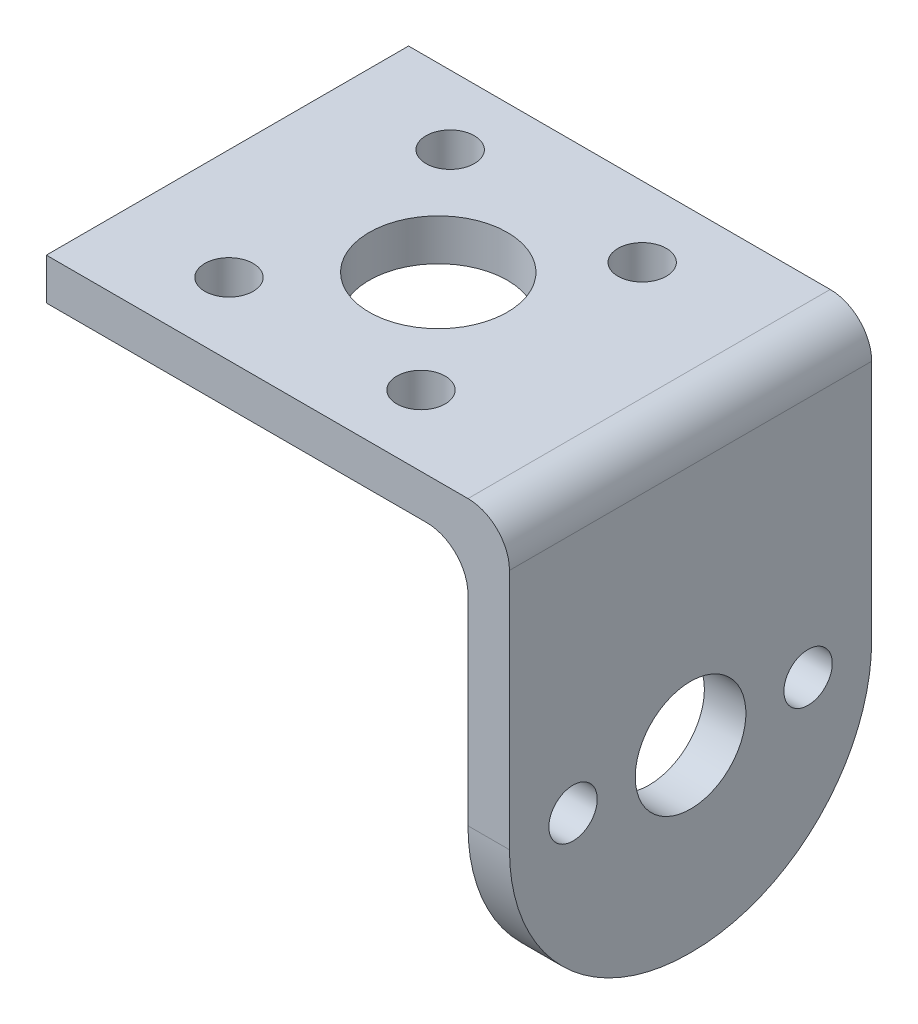
ISO-10303-21;
HEADER;
FILE_DESCRIPTION(('STEP AP214'),'2;1');
FILE_NAME('part.step','',(''),(''),'','','');
FILE_SCHEMA(('AUTOMOTIVE_DESIGN { 1 0 10303 214 1 1 1 1 }'));
ENDSEC;
DATA;
#1=APPLICATION_CONTEXT('core data for automotive mechanical design processes');
#2=APPLICATION_PROTOCOL_DEFINITION('international standard','automotive_design',2000,#1);
#3=PRODUCT_CONTEXT('',#1,'mechanical');
#4=PRODUCT('Part','Part','',(#3));
#5=PRODUCT_RELATED_PRODUCT_CATEGORY('part','',(#4));
#6=PRODUCT_DEFINITION_FORMATION('','',#4);
#7=PRODUCT_DEFINITION_CONTEXT('part definition',#1,'design');
#8=PRODUCT_DEFINITION('design','',#6,#7);
#9=PRODUCT_DEFINITION_SHAPE('','',#8);
#10=(LENGTH_UNIT() NAMED_UNIT(*) SI_UNIT(.MILLI.,.METRE.));
#11=(NAMED_UNIT(*) PLANE_ANGLE_UNIT() SI_UNIT($,.RADIAN.));
#12=(NAMED_UNIT(*) SI_UNIT($,.STERADIAN.) SOLID_ANGLE_UNIT());
#13=UNCERTAINTY_MEASURE_WITH_UNIT(LENGTH_MEASURE(1.E-05),#10,'distance_accuracy_value','');
#14=(GEOMETRIC_REPRESENTATION_CONTEXT(3) GLOBAL_UNCERTAINTY_ASSIGNED_CONTEXT((#13)) GLOBAL_UNIT_ASSIGNED_CONTEXT((#10,
#11,#12)) REPRESENTATION_CONTEXT('',''));
#15=CARTESIAN_POINT('',(0.,0.,0.));
#16=DIRECTION('',(0.,0.,1.));
#17=DIRECTION('',(1.,0.,0.));
#18=AXIS2_PLACEMENT_3D('',#15,#16,#17);
#19=CARTESIAN_POINT('',(0.,3.,0.));
#20=DIRECTION('',(1.,0.,0.));
#21=DIRECTION('',(0.,0.,-1.));
#22=AXIS2_PLACEMENT_3D('',#19,#20,#21);
#23=PLANE('',#22);
#24=DIRECTION('',(0.,0.,1.));
#25=VECTOR('',#24,1.);
#26=CARTESIAN_POINT('',(0.,0.,0.));
#27=LINE('',#26,#25);
#28=CARTESIAN_POINT('',(0.,0.,-26.2));
#29=VERTEX_POINT('',#28);
#30=CARTESIAN_POINT('',(0.,0.,0.));
#31=VERTEX_POINT('',#30);
#32=EDGE_CURVE('E149',#29,#31,#27,.T.);
#33=ORIENTED_EDGE('',*,*,#32,.T.);
#34=DIRECTION('',(0.,-1.,0.));
#35=VECTOR('',#34,1.);
#36=CARTESIAN_POINT('',(0.,3.,0.));
#37=LINE('',#36,#35);
#38=CARTESIAN_POINT('',(0.,3.,0.));
#39=VERTEX_POINT('',#38);
#40=EDGE_CURVE('E129',#39,#31,#37,.T.);
#41=ORIENTED_EDGE('',*,*,#40,.F.);
#42=DIRECTION('',(0.,0.,1.));
#43=VECTOR('',#42,1.);
#44=CARTESIAN_POINT('',(0.,3.,0.));
#45=LINE('',#44,#43);
#46=CARTESIAN_POINT('',(0.,3.,-26.2));
#47=VERTEX_POINT('',#46);
#48=EDGE_CURVE('E138',#47,#39,#45,.T.);
#49=ORIENTED_EDGE('',*,*,#48,.F.);
#50=DIRECTION('',(0.,-1.,0.));
#51=VECTOR('',#50,1.);
#52=CARTESIAN_POINT('',(0.,3.,-26.2));
#53=LINE('',#52,#51);
#54=EDGE_CURVE('E285',#47,#29,#53,.T.);
#55=ORIENTED_EDGE('',*,*,#54,.T.);
#56=EDGE_LOOP('',(#33,#41,#49,#55));
#57=FACE_BOUND('',#56,.T.);
#58=ADVANCED_FACE('F45',(#57),#23,.F.);
#59=CARTESIAN_POINT('',(0.,3.,0.));
#60=DIRECTION('',(0.,0.,-1.));
#61=DIRECTION('',(-1.,0.,0.));
#62=AXIS2_PLACEMENT_3D('',#59,#60,#61);
#63=PLANE('',#62);
#64=DIRECTION('',(0.,-1.,0.));
#65=VECTOR('',#64,1.);
#66=CARTESIAN_POINT('',(33.5,3.,0.));
#67=LINE('',#66,#65);
#68=CARTESIAN_POINT('',(33.5,0.,0.));
#69=VERTEX_POINT('',#68);
#70=CARTESIAN_POINT('',(33.5,-17.5,0.));
#71=VERTEX_POINT('',#70);
#72=EDGE_CURVE('E152',#69,#71,#67,.T.);
#73=ORIENTED_EDGE('',*,*,#72,.F.);
#74=CARTESIAN_POINT('',(30.5,0.,0.));
#75=DIRECTION('',(0.,0.,-1.));
#76=DIRECTION('',(-1.,0.,0.));
#77=AXIS2_PLACEMENT_3D('',#74,#75,#76);
#78=CIRCLE('',#77,3.);
#79=CARTESIAN_POINT('',(30.5,3.,0.));
#80=VERTEX_POINT('',#79);
#81=EDGE_CURVE('E132',#69,#80,#78,.F.);
#82=ORIENTED_EDGE('',*,*,#81,.T.);
#83=DIRECTION('',(1.,0.,0.));
#84=VECTOR('',#83,1.);
#85=CARTESIAN_POINT('',(0.,3.,0.));
#86=LINE('',#85,#84);
#87=EDGE_CURVE('E124',#39,#80,#86,.T.);
#88=ORIENTED_EDGE('',*,*,#87,.F.);
#89=ORIENTED_EDGE('',*,*,#40,.T.);
#90=DIRECTION('',(1.,0.,0.));
#91=VECTOR('',#90,1.);
#92=CARTESIAN_POINT('',(0.,0.,0.));
#93=LINE('',#92,#91);
#94=CARTESIAN_POINT('',(27.5,0.,0.));
#95=VERTEX_POINT('',#94);
#96=EDGE_CURVE('E288',#31,#95,#93,.T.);
#97=ORIENTED_EDGE('',*,*,#96,.T.);
#98=CARTESIAN_POINT('',(27.5,-3.,0.));
#99=DIRECTION('',(0.,0.,-1.));
#100=DIRECTION('',(-1.,0.,0.));
#101=AXIS2_PLACEMENT_3D('',#98,#99,#100);
#102=CIRCLE('',#101,3.);
#103=CARTESIAN_POINT('',(30.5,-3.00000000000001,0.));
#104=VERTEX_POINT('',#103);
#105=EDGE_CURVE('E11',#95,#104,#102,.T.);
#106=ORIENTED_EDGE('',*,*,#105,.T.);
#107=DIRECTION('',(0.,1.,0.));
#108=VECTOR('',#107,1.);
#109=CARTESIAN_POINT('',(30.5,-30.5,0.));
#110=LINE('',#109,#108);
#111=CARTESIAN_POINT('',(30.5,-17.5,0.));
#112=VERTEX_POINT('',#111);
#113=EDGE_CURVE('E279',#112,#104,#110,.T.);
#114=ORIENTED_EDGE('',*,*,#113,.F.);
#115=DIRECTION('',(-1.,0.,0.));
#116=VECTOR('',#115,1.);
#117=CARTESIAN_POINT('',(33.5,-17.5,0.));
#118=LINE('',#117,#116);
#119=EDGE_CURVE('E172',#112,#71,#118,.F.);
#120=ORIENTED_EDGE('',*,*,#119,.T.);
#121=EDGE_LOOP('',(#73,#82,#88,#89,#97,#106,#114,#120));
#122=FACE_BOUND('',#121,.T.);
#123=ADVANCED_FACE('F126',(#122),#63,.F.);
#124=CARTESIAN_POINT('',(33.5,3.,0.));
#125=DIRECTION('',(-1.,0.,0.));
#126=DIRECTION('',(0.,0.,1.));
#127=AXIS2_PLACEMENT_3D('',#124,#125,#126);
#128=PLANE('',#127);
#129=CARTESIAN_POINT('',(33.5,-17.5,-21.6));
#130=DIRECTION('',(-1.,0.,0.));
#131=DIRECTION('',(0.,0.,1.));
#132=AXIS2_PLACEMENT_3D('',#129,#130,#131);
#133=CIRCLE('',#132,1.75);
#134=CARTESIAN_POINT('',(33.5,-17.5,-19.85));
#135=VERTEX_POINT('',#134);
#136=EDGE_CURVE('E223',#135,#135,#133,.F.);
#137=ORIENTED_EDGE('',*,*,#136,.F.);
#138=EDGE_LOOP('',(#137));
#139=FACE_BOUND('',#138,.T.);
#140=CARTESIAN_POINT('',(33.5,-17.5,-4.6));
#141=DIRECTION('',(-1.,0.,0.));
#142=DIRECTION('',(0.,0.,1.));
#143=AXIS2_PLACEMENT_3D('',#140,#141,#142);
#144=CIRCLE('',#143,1.75);
#145=CARTESIAN_POINT('',(33.5,-17.5,-2.85));
#146=VERTEX_POINT('',#145);
#147=EDGE_CURVE('E211',#146,#146,#144,.F.);
#148=ORIENTED_EDGE('',*,*,#147,.F.);
#149=EDGE_LOOP('',(#148));
#150=FACE_BOUND('',#149,.T.);
#151=CARTESIAN_POINT('',(33.5,-17.5,-13.1));
#152=DIRECTION('',(-1.,0.,0.));
#153=DIRECTION('',(0.,0.,1.));
#154=AXIS2_PLACEMENT_3D('',#151,#152,#153);
#155=CIRCLE('',#154,4.);
#156=CARTESIAN_POINT('',(33.5,-17.5,-9.1));
#157=VERTEX_POINT('',#156);
#158=EDGE_CURVE('E207',#157,#157,#155,.F.);
#159=ORIENTED_EDGE('',*,*,#158,.F.);
#160=EDGE_LOOP('',(#159));
#161=FACE_BOUND('',#160,.T.);
#162=DIRECTION('',(0.,-1.,0.));
#163=VECTOR('',#162,1.);
#164=CARTESIAN_POINT('',(33.5,3.,-26.2));
#165=LINE('',#164,#163);
#166=CARTESIAN_POINT('',(33.5,0.,-26.2));
#167=VERTEX_POINT('',#166);
#168=CARTESIAN_POINT('',(33.5,-17.5,-26.2));
#169=VERTEX_POINT('',#168);
#170=EDGE_CURVE('E159',#167,#169,#165,.T.);
#171=ORIENTED_EDGE('',*,*,#170,.F.);
#172=DIRECTION('',(0.,0.,-1.));
#173=VECTOR('',#172,1.);
#174=CARTESIAN_POINT('',(33.5,0.,0.));
#175=LINE('',#174,#173);
#176=EDGE_CURVE('E63',#167,#69,#175,.F.);
#177=ORIENTED_EDGE('',*,*,#176,.T.);
#178=ORIENTED_EDGE('',*,*,#72,.T.);
#179=CARTESIAN_POINT('',(33.5,-17.5,-13.));
#180=DIRECTION('',(-1.,0.,0.));
#181=DIRECTION('',(0.,0.,1.));
#182=AXIS2_PLACEMENT_3D('',#179,#180,#181);
#183=CIRCLE('',#182,13.);
#184=CARTESIAN_POINT('',(33.5,-30.5,-13.));
#185=VERTEX_POINT('',#184);
#186=EDGE_CURVE('E180',#71,#185,#183,.F.);
#187=ORIENTED_EDGE('',*,*,#186,.T.);
#188=DIRECTION('',(0.,0.,1.));
#189=VECTOR('',#188,1.);
#190=CARTESIAN_POINT('',(33.5,-30.5,0.));
#191=LINE('',#190,#189);
#192=CARTESIAN_POINT('',(33.5,-30.5,-13.2));
#193=VERTEX_POINT('',#192);
#194=EDGE_CURVE('E264',#193,#185,#191,.T.);
#195=ORIENTED_EDGE('',*,*,#194,.F.);
#196=CARTESIAN_POINT('',(33.5,-17.5,-13.2));
#197=DIRECTION('',(-1.,0.,0.));
#198=DIRECTION('',(0.,0.,1.));
#199=AXIS2_PLACEMENT_3D('',#196,#197,#198);
#200=CIRCLE('',#199,13.);
#201=EDGE_CURVE('E176',#193,#169,#200,.F.);
#202=ORIENTED_EDGE('',*,*,#201,.T.);
#203=EDGE_LOOP('',(#171,#177,#178,#187,#195,#202));
#204=FACE_BOUND('',#203,.T.);
#205=ADVANCED_FACE('F299',(#139,#150,#161,#204),#128,.F.);
#206=CARTESIAN_POINT('',(0.,3.,-26.2));
#207=DIRECTION('',(0.,0.,1.));
#208=DIRECTION('',(1.,0.,0.));
#209=AXIS2_PLACEMENT_3D('',#206,#207,#208);
#210=PLANE('',#209);
#211=DIRECTION('',(-1.,0.,0.));
#212=VECTOR('',#211,1.);
#213=CARTESIAN_POINT('',(0.,3.,-26.2));
#214=LINE('',#213,#212);
#215=CARTESIAN_POINT('',(30.5,3.,-26.2));
#216=VERTEX_POINT('',#215);
#217=EDGE_CURVE('E137',#216,#47,#214,.T.);
#218=ORIENTED_EDGE('',*,*,#217,.F.);
#219=CARTESIAN_POINT('',(30.5,0.,-26.2));
#220=DIRECTION('',(0.,0.,1.));
#221=DIRECTION('',(1.,0.,0.));
#222=AXIS2_PLACEMENT_3D('',#219,#220,#221);
#223=CIRCLE('',#222,3.);
#224=EDGE_CURVE('E71',#216,#167,#223,.F.);
#225=ORIENTED_EDGE('',*,*,#224,.T.);
#226=ORIENTED_EDGE('',*,*,#170,.T.);
#227=DIRECTION('',(1.,0.,0.));
#228=VECTOR('',#227,1.);
#229=CARTESIAN_POINT('',(30.5,-17.5,-26.2));
#230=LINE('',#229,#228);
#231=CARTESIAN_POINT('',(30.5,-17.5,-26.2));
#232=VERTEX_POINT('',#231);
#233=EDGE_CURVE('E183',#169,#232,#230,.F.);
#234=ORIENTED_EDGE('',*,*,#233,.T.);
#235=DIRECTION('',(0.,1.,0.));
#236=VECTOR('',#235,1.);
#237=CARTESIAN_POINT('',(30.5,-30.5,-26.2));
#238=LINE('',#237,#236);
#239=CARTESIAN_POINT('',(30.5,-3.00000000000001,-26.2));
#240=VERTEX_POINT('',#239);
#241=EDGE_CURVE('E275',#232,#240,#238,.T.);
#242=ORIENTED_EDGE('',*,*,#241,.T.);
#243=CARTESIAN_POINT('',(27.5,-3.,-26.2));
#244=DIRECTION('',(0.,0.,1.));
#245=DIRECTION('',(1.,0.,0.));
#246=AXIS2_PLACEMENT_3D('',#243,#244,#245);
#247=CIRCLE('',#246,3.);
#248=CARTESIAN_POINT('',(27.5,0.,-26.2));
#249=VERTEX_POINT('',#248);
#250=EDGE_CURVE('E55',#240,#249,#247,.T.);
#251=ORIENTED_EDGE('',*,*,#250,.T.);
#252=DIRECTION('',(-1.,0.,0.));
#253=VECTOR('',#252,1.);
#254=CARTESIAN_POINT('',(0.,0.,-26.2));
#255=LINE('',#254,#253);
#256=EDGE_CURVE('E146',#249,#29,#255,.T.);
#257=ORIENTED_EDGE('',*,*,#256,.T.);
#258=ORIENTED_EDGE('',*,*,#54,.F.);
#259=EDGE_LOOP('',(#218,#225,#226,#234,#242,#251,#257,#258));
#260=FACE_BOUND('',#259,.T.);
#261=ADVANCED_FACE('F295',(#260),#210,.F.);
#262=CARTESIAN_POINT('',(0.,3.,0.));
#263=DIRECTION('',(0.,-1.,0.));
#264=DIRECTION('',(0.,0.,-1.));
#265=AXIS2_PLACEMENT_3D('',#262,#263,#264);
#266=PLANE('',#265);
#267=CARTESIAN_POINT('',(8.,3.,-5.21134733643946));
#268=DIRECTION('',(0.,-1.,0.));
#269=DIRECTION('',(0.,0.,-1.));
#270=AXIS2_PLACEMENT_3D('',#267,#268,#269);
#271=CIRCLE('',#270,1.75);
#272=CARTESIAN_POINT('',(8.,3.,-6.96134733643946));
#273=VERTEX_POINT('',#272);
#274=EDGE_CURVE('E249',#273,#273,#271,.T.);
#275=ORIENTED_EDGE('',*,*,#274,.T.);
#276=EDGE_LOOP('',(#275));
#277=FACE_BOUND('',#276,.T.);
#278=CARTESIAN_POINT('',(22.,3.,-21.1));
#279=DIRECTION('',(0.,-1.,0.));
#280=DIRECTION('',(0.,0.,-1.));
#281=AXIS2_PLACEMENT_3D('',#278,#279,#280);
#282=CIRCLE('',#281,1.75);
#283=CARTESIAN_POINT('',(22.,3.,-22.85));
#284=VERTEX_POINT('',#283);
#285=EDGE_CURVE('E232',#284,#284,#282,.T.);
#286=ORIENTED_EDGE('',*,*,#285,.T.);
#287=EDGE_LOOP('',(#286));
#288=FACE_BOUND('',#287,.T.);
#289=CARTESIAN_POINT('',(22.,3.,-5.09999999999999));
#290=DIRECTION('',(0.,-1.,0.));
#291=DIRECTION('',(0.,0.,-1.));
#292=AXIS2_PLACEMENT_3D('',#289,#290,#291);
#293=CIRCLE('',#292,1.75);
#294=CARTESIAN_POINT('',(22.,3.,-6.84999999999999));
#295=VERTEX_POINT('',#294);
#296=EDGE_CURVE('E233',#295,#295,#293,.T.);
#297=ORIENTED_EDGE('',*,*,#296,.T.);
#298=EDGE_LOOP('',(#297));
#299=FACE_BOUND('',#298,.T.);
#300=CARTESIAN_POINT('',(15.25,3.,-13.1));
#301=DIRECTION('',(0.,-1.,0.));
#302=DIRECTION('',(0.,0.,-1.));
#303=AXIS2_PLACEMENT_3D('',#300,#301,#302);
#304=CIRCLE('',#303,5.);
#305=CARTESIAN_POINT('',(15.25,3.,-18.1));
#306=VERTEX_POINT('',#305);
#307=EDGE_CURVE('E227',#306,#306,#304,.T.);
#308=ORIENTED_EDGE('',*,*,#307,.T.);
#309=EDGE_LOOP('',(#308));
#310=FACE_BOUND('',#309,.T.);
#311=CARTESIAN_POINT('',(8.,3.,-21.2113473364395));
#312=DIRECTION('',(0.,-1.,0.));
#313=DIRECTION('',(0.,0.,-1.));
#314=AXIS2_PLACEMENT_3D('',#311,#312,#313);
#315=CIRCLE('',#314,1.75);
#316=CARTESIAN_POINT('',(8.,3.,-22.9613473364395));
#317=VERTEX_POINT('',#316);
#318=EDGE_CURVE('E260',#317,#317,#315,.T.);
#319=ORIENTED_EDGE('',*,*,#318,.T.);
#320=EDGE_LOOP('',(#319));
#321=FACE_BOUND('',#320,.T.);
#322=ORIENTED_EDGE('',*,*,#87,.T.);
#323=DIRECTION('',(0.,0.,-1.));
#324=VECTOR('',#323,1.);
#325=CARTESIAN_POINT('',(30.5,3.,0.));
#326=LINE('',#325,#324);
#327=EDGE_CURVE('E193',#80,#216,#326,.T.);
#328=ORIENTED_EDGE('',*,*,#327,.T.);
#329=ORIENTED_EDGE('',*,*,#217,.T.);
#330=ORIENTED_EDGE('',*,*,#48,.T.);
#331=EDGE_LOOP('',(#322,#328,#329,#330));
#332=FACE_BOUND('',#331,.T.);
#333=ADVANCED_FACE('F141',(#277,#288,#299,#310,#321,#332),#266,.F.);
#334=CARTESIAN_POINT('',(0.,0.,0.));
#335=DIRECTION('',(0.,-1.,0.));
#336=DIRECTION('',(0.,0.,-1.));
#337=AXIS2_PLACEMENT_3D('',#334,#335,#336);
#338=PLANE('',#337);
#339=CARTESIAN_POINT('',(8.,0.,-5.21134733643946));
#340=DIRECTION('',(0.,-1.,0.));
#341=DIRECTION('',(0.,0.,-1.));
#342=AXIS2_PLACEMENT_3D('',#339,#340,#341);
#343=CIRCLE('',#342,1.75);
#344=CARTESIAN_POINT('',(8.,0.,-6.96134733643946));
#345=VERTEX_POINT('',#344);
#346=EDGE_CURVE('E244',#345,#345,#343,.T.);
#347=ORIENTED_EDGE('',*,*,#346,.F.);
#348=EDGE_LOOP('',(#347));
#349=FACE_BOUND('',#348,.T.);
#350=CARTESIAN_POINT('',(22.,0.,-21.1));
#351=DIRECTION('',(0.,-1.,0.));
#352=DIRECTION('',(0.,0.,-1.));
#353=AXIS2_PLACEMENT_3D('',#350,#351,#352);
#354=CIRCLE('',#353,1.75);
#355=CARTESIAN_POINT('',(22.,0.,-22.85));
#356=VERTEX_POINT('',#355);
#357=EDGE_CURVE('E253',#356,#356,#354,.T.);
#358=ORIENTED_EDGE('',*,*,#357,.F.);
#359=EDGE_LOOP('',(#358));
#360=FACE_BOUND('',#359,.T.);
#361=CARTESIAN_POINT('',(22.,0.,-5.09999999999999));
#362=DIRECTION('',(0.,-1.,0.));
#363=DIRECTION('',(0.,0.,-1.));
#364=AXIS2_PLACEMENT_3D('',#361,#362,#363);
#365=CIRCLE('',#364,1.75);
#366=CARTESIAN_POINT('',(22.,0.,-6.84999999999999));
#367=VERTEX_POINT('',#366);
#368=EDGE_CURVE('E228',#367,#367,#365,.T.);
#369=ORIENTED_EDGE('',*,*,#368,.F.);
#370=EDGE_LOOP('',(#369));
#371=FACE_BOUND('',#370,.T.);
#372=CARTESIAN_POINT('',(15.25,0.,-13.1));
#373=DIRECTION('',(0.,-1.,0.));
#374=DIRECTION('',(0.,0.,-1.));
#375=AXIS2_PLACEMENT_3D('',#372,#373,#374);
#376=CIRCLE('',#375,5.);
#377=CARTESIAN_POINT('',(15.25,0.,-18.1));
#378=VERTEX_POINT('',#377);
#379=EDGE_CURVE('E237',#378,#378,#376,.T.);
#380=ORIENTED_EDGE('',*,*,#379,.F.);
#381=EDGE_LOOP('',(#380));
#382=FACE_BOUND('',#381,.T.);
#383=CARTESIAN_POINT('',(8.,0.,-21.2113473364395));
#384=DIRECTION('',(0.,-1.,0.));
#385=DIRECTION('',(0.,0.,-1.));
#386=AXIS2_PLACEMENT_3D('',#383,#384,#385);
#387=CIRCLE('',#386,1.75);
#388=CARTESIAN_POINT('',(8.,0.,-22.9613473364395));
#389=VERTEX_POINT('',#388);
#390=EDGE_CURVE('E248',#389,#389,#387,.T.);
#391=ORIENTED_EDGE('',*,*,#390,.F.);
#392=EDGE_LOOP('',(#391));
#393=FACE_BOUND('',#392,.T.);
#394=ORIENTED_EDGE('',*,*,#256,.F.);
#395=DIRECTION('',(0.,0.,-1.));
#396=VECTOR('',#395,1.);
#397=CARTESIAN_POINT('',(27.5,0.,0.));
#398=LINE('',#397,#396);
#399=EDGE_CURVE('E190',#249,#95,#398,.F.);
#400=ORIENTED_EDGE('',*,*,#399,.T.);
#401=ORIENTED_EDGE('',*,*,#96,.F.);
#402=ORIENTED_EDGE('',*,*,#32,.F.);
#403=EDGE_LOOP('',(#394,#400,#401,#402));
#404=FACE_BOUND('',#403,.T.);
#405=ADVANCED_FACE('F322',(#349,#360,#371,#382,#393,#404),#338,.T.);
#406=CARTESIAN_POINT('',(30.5,-30.5,0.));
#407=DIRECTION('',(1.,0.,0.));
#408=DIRECTION('',(0.,0.,-1.));
#409=AXIS2_PLACEMENT_3D('',#406,#407,#408);
#410=PLANE('',#409);
#411=CARTESIAN_POINT('',(30.5,-17.5,-21.6));
#412=DIRECTION('',(1.,0.,0.));
#413=DIRECTION('',(0.,0.,-1.));
#414=AXIS2_PLACEMENT_3D('',#411,#412,#413);
#415=CIRCLE('',#414,1.75);
#416=CARTESIAN_POINT('',(30.5,-17.5,-23.35));
#417=VERTEX_POINT('',#416);
#418=EDGE_CURVE('E49',#417,#417,#415,.F.);
#419=ORIENTED_EDGE('',*,*,#418,.F.);
#420=EDGE_LOOP('',(#419));
#421=FACE_BOUND('',#420,.T.);
#422=CARTESIAN_POINT('',(30.5,-17.5,-4.6));
#423=DIRECTION('',(1.,0.,0.));
#424=DIRECTION('',(0.,0.,-1.));
#425=AXIS2_PLACEMENT_3D('',#422,#423,#424);
#426=CIRCLE('',#425,1.75);
#427=CARTESIAN_POINT('',(30.5,-17.5,-6.35));
#428=VERTEX_POINT('',#427);
#429=EDGE_CURVE('E208',#428,#428,#426,.F.);
#430=ORIENTED_EDGE('',*,*,#429,.F.);
#431=EDGE_LOOP('',(#430));
#432=FACE_BOUND('',#431,.T.);
#433=CARTESIAN_POINT('',(30.5,-17.5,-13.1));
#434=DIRECTION('',(1.,0.,0.));
#435=DIRECTION('',(0.,0.,-1.));
#436=AXIS2_PLACEMENT_3D('',#433,#434,#435);
#437=CIRCLE('',#436,4.);
#438=CARTESIAN_POINT('',(30.5,-17.5,-17.1));
#439=VERTEX_POINT('',#438);
#440=EDGE_CURVE('E204',#439,#439,#437,.F.);
#441=ORIENTED_EDGE('',*,*,#440,.F.);
#442=EDGE_LOOP('',(#441));
#443=FACE_BOUND('',#442,.T.);
#444=ORIENTED_EDGE('',*,*,#113,.T.);
#445=DIRECTION('',(0.,0.,-1.));
#446=VECTOR('',#445,1.);
#447=CARTESIAN_POINT('',(30.5,-3.,0.));
#448=LINE('',#447,#446);
#449=EDGE_CURVE('E186',#104,#240,#448,.T.);
#450=ORIENTED_EDGE('',*,*,#449,.T.);
#451=ORIENTED_EDGE('',*,*,#241,.F.);
#452=CARTESIAN_POINT('',(30.5,-17.5,-13.2));
#453=DIRECTION('',(1.,0.,0.));
#454=DIRECTION('',(0.,0.,-1.));
#455=AXIS2_PLACEMENT_3D('',#452,#453,#454);
#456=CIRCLE('',#455,13.);
#457=CARTESIAN_POINT('',(30.5,-30.5,-13.2));
#458=VERTEX_POINT('',#457);
#459=EDGE_CURVE('E166',#232,#458,#456,.F.);
#460=ORIENTED_EDGE('',*,*,#459,.T.);
#461=DIRECTION('',(0.,0.,-1.));
#462=VECTOR('',#461,1.);
#463=CARTESIAN_POINT('',(30.5,-30.5,0.));
#464=LINE('',#463,#462);
#465=CARTESIAN_POINT('',(30.5,-30.5,-13.));
#466=VERTEX_POINT('',#465);
#467=EDGE_CURVE('E271',#466,#458,#464,.T.);
#468=ORIENTED_EDGE('',*,*,#467,.F.);
#469=CARTESIAN_POINT('',(30.5,-17.5,-13.));
#470=DIRECTION('',(1.,0.,0.));
#471=DIRECTION('',(0.,0.,-1.));
#472=AXIS2_PLACEMENT_3D('',#469,#470,#471);
#473=CIRCLE('',#472,13.);
#474=EDGE_CURVE('E169',#466,#112,#473,.F.);
#475=ORIENTED_EDGE('',*,*,#474,.T.);
#476=EDGE_LOOP('',(#444,#450,#451,#460,#468,#475));
#477=FACE_BOUND('',#476,.T.);
#478=ADVANCED_FACE('F306',(#421,#432,#443,#477),#410,.F.);
#479=CARTESIAN_POINT('',(0.,-30.5,0.));
#480=DIRECTION('',(0.,-1.,0.));
#481=DIRECTION('',(0.,0.,-1.));
#482=AXIS2_PLACEMENT_3D('',#479,#480,#481);
#483=PLANE('',#482);
#484=ORIENTED_EDGE('',*,*,#194,.T.);
#485=DIRECTION('',(-1.,0.,0.));
#486=VECTOR('',#485,1.);
#487=CARTESIAN_POINT('',(30.5,-30.5,-13.));
#488=LINE('',#487,#486);
#489=EDGE_CURVE('E157',#185,#466,#488,.T.);
#490=ORIENTED_EDGE('',*,*,#489,.T.);
#491=ORIENTED_EDGE('',*,*,#467,.T.);
#492=DIRECTION('',(1.,0.,0.));
#493=VECTOR('',#492,1.);
#494=CARTESIAN_POINT('',(33.5,-30.5,-13.2));
#495=LINE('',#494,#493);
#496=EDGE_CURVE('E151',#458,#193,#495,.T.);
#497=ORIENTED_EDGE('',*,*,#496,.T.);
#498=EDGE_LOOP('',(#484,#490,#491,#497));
#499=FACE_BOUND('',#498,.T.);
#500=ADVANCED_FACE('F308',(#499),#483,.T.);
#501=CARTESIAN_POINT('',(0.,-17.5,-13.));
#502=DIRECTION('',(1.,0.,0.));
#503=DIRECTION('',(0.,0.,-1.));
#504=AXIS2_PLACEMENT_3D('',#501,#502,#503);
#505=CYLINDRICAL_SURFACE('',#504,13.);
#506=ORIENTED_EDGE('',*,*,#186,.F.);
#507=ORIENTED_EDGE('',*,*,#119,.F.);
#508=ORIENTED_EDGE('',*,*,#474,.F.);
#509=ORIENTED_EDGE('',*,*,#489,.F.);
#510=EDGE_LOOP('',(#506,#507,#508,#509));
#511=FACE_BOUND('',#510,.T.);
#512=ADVANCED_FACE('F312',(#511),#505,.T.);
#513=CARTESIAN_POINT('',(0.,-17.5,-13.2));
#514=DIRECTION('',(-1.,0.,0.));
#515=DIRECTION('',(0.,0.,1.));
#516=AXIS2_PLACEMENT_3D('',#513,#514,#515);
#517=CYLINDRICAL_SURFACE('',#516,13.);
#518=ORIENTED_EDGE('',*,*,#459,.F.);
#519=ORIENTED_EDGE('',*,*,#233,.F.);
#520=ORIENTED_EDGE('',*,*,#201,.F.);
#521=ORIENTED_EDGE('',*,*,#496,.F.);
#522=EDGE_LOOP('',(#518,#519,#520,#521));
#523=FACE_BOUND('',#522,.T.);
#524=ADVANCED_FACE('F303',(#523),#517,.T.);
#525=CARTESIAN_POINT('',(8.,3.,-21.2113473364395));
#526=DIRECTION('',(0.,-1.,0.));
#527=DIRECTION('',(0.,0.,-1.));
#528=AXIS2_PLACEMENT_3D('',#525,#526,#527);
#529=CYLINDRICAL_SURFACE('',#528,1.75);
#530=ORIENTED_EDGE('',*,*,#318,.F.);
#531=EDGE_LOOP('',(#530));
#532=FACE_BOUND('',#531,.T.);
#533=ORIENTED_EDGE('',*,*,#390,.T.);
#534=EDGE_LOOP('',(#533));
#535=FACE_BOUND('',#534,.T.);
#536=ADVANCED_FACE('F350',(#532,#535),#529,.F.);
#537=CARTESIAN_POINT('',(15.25,3.,-13.1));
#538=DIRECTION('',(0.,-1.,0.));
#539=DIRECTION('',(0.,0.,-1.));
#540=AXIS2_PLACEMENT_3D('',#537,#538,#539);
#541=CYLINDRICAL_SURFACE('',#540,5.);
#542=ORIENTED_EDGE('',*,*,#307,.F.);
#543=EDGE_LOOP('',(#542));
#544=FACE_BOUND('',#543,.T.);
#545=ORIENTED_EDGE('',*,*,#379,.T.);
#546=EDGE_LOOP('',(#545));
#547=FACE_BOUND('',#546,.T.);
#548=ADVANCED_FACE('F370',(#544,#547),#541,.F.);
#549=CARTESIAN_POINT('',(22.,3.,-5.09999999999999));
#550=DIRECTION('',(0.,-1.,0.));
#551=DIRECTION('',(0.,0.,-1.));
#552=AXIS2_PLACEMENT_3D('',#549,#550,#551);
#553=CYLINDRICAL_SURFACE('',#552,1.75);
#554=ORIENTED_EDGE('',*,*,#296,.F.);
#555=EDGE_LOOP('',(#554));
#556=FACE_BOUND('',#555,.T.);
#557=ORIENTED_EDGE('',*,*,#368,.T.);
#558=EDGE_LOOP('',(#557));
#559=FACE_BOUND('',#558,.T.);
#560=ADVANCED_FACE('F364',(#556,#559),#553,.F.);
#561=CARTESIAN_POINT('',(22.,3.,-21.1));
#562=DIRECTION('',(0.,-1.,0.));
#563=DIRECTION('',(0.,0.,-1.));
#564=AXIS2_PLACEMENT_3D('',#561,#562,#563);
#565=CYLINDRICAL_SURFACE('',#564,1.75);
#566=ORIENTED_EDGE('',*,*,#285,.F.);
#567=EDGE_LOOP('',(#566));
#568=FACE_BOUND('',#567,.T.);
#569=ORIENTED_EDGE('',*,*,#357,.T.);
#570=EDGE_LOOP('',(#569));
#571=FACE_BOUND('',#570,.T.);
#572=ADVANCED_FACE('F358',(#568,#571),#565,.F.);
#573=CARTESIAN_POINT('',(8.,3.,-5.21134733643946));
#574=DIRECTION('',(0.,-1.,0.));
#575=DIRECTION('',(0.,0.,-1.));
#576=AXIS2_PLACEMENT_3D('',#573,#574,#575);
#577=CYLINDRICAL_SURFACE('',#576,1.75);
#578=ORIENTED_EDGE('',*,*,#274,.F.);
#579=EDGE_LOOP('',(#578));
#580=FACE_BOUND('',#579,.T.);
#581=ORIENTED_EDGE('',*,*,#346,.T.);
#582=EDGE_LOOP('',(#581));
#583=FACE_BOUND('',#582,.T.);
#584=ADVANCED_FACE('F351',(#580,#583),#577,.F.);
#585=CARTESIAN_POINT('',(27.5,-3.,0.));
#586=DIRECTION('',(0.,0.,-1.));
#587=DIRECTION('',(-1.,0.,0.));
#588=AXIS2_PLACEMENT_3D('',#585,#586,#587);
#589=CYLINDRICAL_SURFACE('',#588,3.);
#590=ORIENTED_EDGE('',*,*,#105,.F.);
#591=ORIENTED_EDGE('',*,*,#399,.F.);
#592=ORIENTED_EDGE('',*,*,#250,.F.);
#593=ORIENTED_EDGE('',*,*,#449,.F.);
#594=EDGE_LOOP('',(#590,#591,#592,#593));
#595=FACE_BOUND('',#594,.T.);
#596=ADVANCED_FACE('F319',(#595),#589,.F.);
#597=CARTESIAN_POINT('',(30.5,0.,0.));
#598=DIRECTION('',(0.,0.,-1.));
#599=DIRECTION('',(-1.,0.,0.));
#600=AXIS2_PLACEMENT_3D('',#597,#598,#599);
#601=CYLINDRICAL_SURFACE('',#600,3.);
#602=ORIENTED_EDGE('',*,*,#81,.F.);
#603=ORIENTED_EDGE('',*,*,#176,.F.);
#604=ORIENTED_EDGE('',*,*,#224,.F.);
#605=ORIENTED_EDGE('',*,*,#327,.F.);
#606=EDGE_LOOP('',(#602,#603,#604,#605));
#607=FACE_BOUND('',#606,.T.);
#608=ADVANCED_FACE('F47',(#607),#601,.T.);
#609=CARTESIAN_POINT('',(33.500012,-17.5,-13.1));
#610=DIRECTION('',(-1.,0.,0.));
#611=DIRECTION('',(0.,0.,1.));
#612=AXIS2_PLACEMENT_3D('',#609,#610,#611);
#613=CYLINDRICAL_SURFACE('',#612,4.);
#614=ORIENTED_EDGE('',*,*,#440,.T.);
#615=EDGE_LOOP('',(#614));
#616=FACE_BOUND('',#615,.T.);
#617=ORIENTED_EDGE('',*,*,#158,.T.);
#618=EDGE_LOOP('',(#617));
#619=FACE_BOUND('',#618,.T.);
#620=ADVANCED_FACE('F355',(#616,#619),#613,.F.);
#621=CARTESIAN_POINT('',(33.500012,-17.5,-4.6));
#622=DIRECTION('',(-1.,0.,0.));
#623=DIRECTION('',(0.,0.,1.));
#624=AXIS2_PLACEMENT_3D('',#621,#622,#623);
#625=CYLINDRICAL_SURFACE('',#624,1.75);
#626=ORIENTED_EDGE('',*,*,#429,.T.);
#627=EDGE_LOOP('',(#626));
#628=FACE_BOUND('',#627,.T.);
#629=ORIENTED_EDGE('',*,*,#147,.T.);
#630=EDGE_LOOP('',(#629));
#631=FACE_BOUND('',#630,.T.);
#632=ADVANCED_FACE('F438',(#628,#631),#625,.F.);
#633=CARTESIAN_POINT('',(33.500012,-17.5,-21.6));
#634=DIRECTION('',(-1.,0.,0.));
#635=DIRECTION('',(0.,0.,1.));
#636=AXIS2_PLACEMENT_3D('',#633,#634,#635);
#637=CYLINDRICAL_SURFACE('',#636,1.75);
#638=ORIENTED_EDGE('',*,*,#418,.T.);
#639=EDGE_LOOP('',(#638));
#640=FACE_BOUND('',#639,.T.);
#641=ORIENTED_EDGE('',*,*,#136,.T.);
#642=EDGE_LOOP('',(#641));
#643=FACE_BOUND('',#642,.T.);
#644=ADVANCED_FACE('F448',(#640,#643),#637,.F.);
#645=CLOSED_SHELL('',(#58,#123,#205,#261,#333,#405,#478,#500,#512,#524,#536,#548,#560,#572,#584,
#596,#608,#620,#632,#644));
#646=MANIFOLD_SOLID_BREP('B2',#645);
#647=ADVANCED_BREP_SHAPE_REPRESENTATION('',(#18,#646),#14);
#648=SHAPE_DEFINITION_REPRESENTATION(#9,#647);
ENDSEC;
END-ISO-10303-21;
